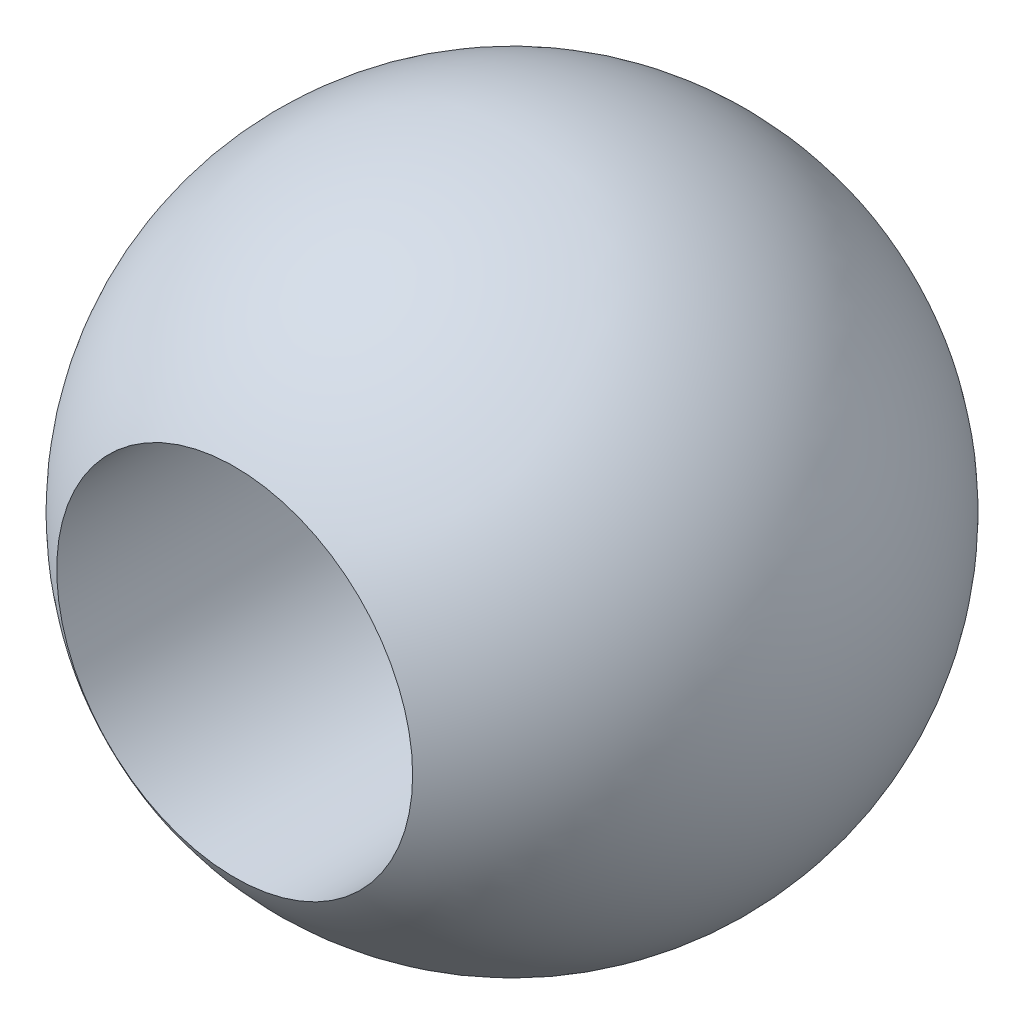
ISO-10303-21;
HEADER;
FILE_DESCRIPTION(('STEP AP214'),'2;1');
FILE_NAME('part.step','',(''),(''),'','','');
FILE_SCHEMA(('AUTOMOTIVE_DESIGN { 1 0 10303 214 1 1 1 1 }'));
ENDSEC;
DATA;
#1=APPLICATION_CONTEXT('core data for automotive mechanical design processes');
#2=APPLICATION_PROTOCOL_DEFINITION('international standard','automotive_design',2000,#1);
#3=PRODUCT_CONTEXT('',#1,'mechanical');
#4=PRODUCT('Part','Part','',(#3));
#5=PRODUCT_RELATED_PRODUCT_CATEGORY('part','',(#4));
#6=PRODUCT_DEFINITION_FORMATION('','',#4);
#7=PRODUCT_DEFINITION_CONTEXT('part definition',#1,'design');
#8=PRODUCT_DEFINITION('design','',#6,#7);
#9=PRODUCT_DEFINITION_SHAPE('','',#8);
#10=(LENGTH_UNIT() NAMED_UNIT(*) SI_UNIT(.MILLI.,.METRE.));
#11=(NAMED_UNIT(*) PLANE_ANGLE_UNIT() SI_UNIT($,.RADIAN.));
#12=(NAMED_UNIT(*) SI_UNIT($,.STERADIAN.) SOLID_ANGLE_UNIT());
#13=UNCERTAINTY_MEASURE_WITH_UNIT(LENGTH_MEASURE(1.E-05),#10,'distance_accuracy_value','');
#14=(GEOMETRIC_REPRESENTATION_CONTEXT(3) GLOBAL_UNCERTAINTY_ASSIGNED_CONTEXT((#13)) GLOBAL_UNIT_ASSIGNED_CONTEXT((#10,
#11,#12)) REPRESENTATION_CONTEXT('',''));
#15=CARTESIAN_POINT('',(0.,0.,0.));
#16=DIRECTION('',(0.,0.,1.));
#17=DIRECTION('',(1.,0.,0.));
#18=AXIS2_PLACEMENT_3D('',#15,#16,#17);
#19=CARTESIAN_POINT('',(0.,0.,0.));
#20=DIRECTION('',(0.,0.,0.999999999999998));
#21=DIRECTION('',(0.999999999999999,0.,0.));
#22=AXIS2_PLACEMENT_3D('',#19,#20,#21);
#23=SPHERICAL_SURFACE('',#22,6.35);
#24=CARTESIAN_POINT('',(0.,0.,5.34457285477528));
#25=DIRECTION('',(0.,0.,0.999999999999998));
#26=DIRECTION('',(0.999999999999999,0.,0.));
#27=AXIS2_PLACEMENT_3D('',#24,#25,#26);
#28=CIRCLE('',#27,3.429);
#29=CARTESIAN_POINT('',(3.42899999999999,0.,5.34457285477529));
#30=VERTEX_POINT('',#29);
#31=EDGE_CURVE('E10',#30,#30,#28,.T.);
#32=ORIENTED_EDGE('',*,*,#31,.F.);
#33=EDGE_LOOP('',(#32));
#34=FACE_BOUND('',#33,.T.);
#35=ADVANCED_FACE('F32',(#34),#23,.T.);
#36=CARTESIAN_POINT('',(0.,0.,0.));
#37=DIRECTION('',(0.,0.,0.999999999999998));
#38=DIRECTION('',(0.999999999999999,0.,0.));
#39=AXIS2_PLACEMENT_3D('',#36,#37,#38);
#40=CYLINDRICAL_SURFACE('',#39,3.429);
#41=ORIENTED_EDGE('',*,*,#31,.T.);
#42=EDGE_LOOP('',(#41));
#43=FACE_BOUND('',#42,.T.);
#44=CARTESIAN_POINT('',(0.,0.,0.));
#45=DIRECTION('',(0.,0.,0.999999999999998));
#46=DIRECTION('',(0.999999999999999,0.,0.));
#47=AXIS2_PLACEMENT_3D('',#44,#45,#46);
#48=CIRCLE('',#47,3.429);
#49=CARTESIAN_POINT('',(3.429,0.,0.));
#50=VERTEX_POINT('',#49);
#51=EDGE_CURVE('E38',#50,#50,#48,.T.);
#52=ORIENTED_EDGE('',*,*,#51,.F.);
#53=EDGE_LOOP('',(#52));
#54=FACE_BOUND('',#53,.T.);
#55=ADVANCED_FACE('F46',(#43,#54),#40,.F.);
#56=CARTESIAN_POINT('',(0.,0.,0.));
#57=DIRECTION('',(0.,0.,0.999999999999998));
#58=DIRECTION('',(0.999999999999999,0.,0.));
#59=AXIS2_PLACEMENT_3D('',#56,#57,#58);
#60=PLANE('',#59);
#61=ORIENTED_EDGE('',*,*,#51,.T.);
#62=EDGE_LOOP('',(#61));
#63=FACE_BOUND('',#62,.T.);
#64=ADVANCED_FACE('F44',(#63),#60,.T.);
#65=CLOSED_SHELL('',(#35,#55,#64));
#66=MANIFOLD_SOLID_BREP('B2',#65);
#67=ADVANCED_BREP_SHAPE_REPRESENTATION('',(#18,#66),#14);
#68=SHAPE_DEFINITION_REPRESENTATION(#9,#67);
ENDSEC;
END-ISO-10303-21;
